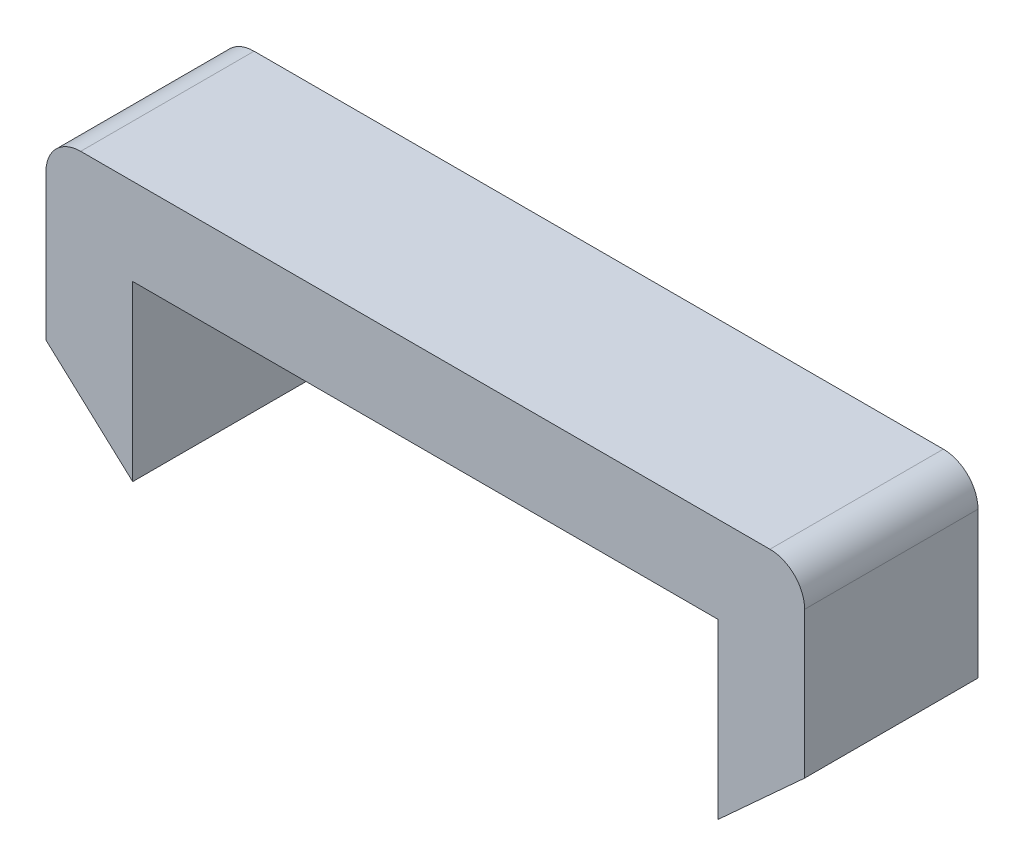
ISO-10303-21;
HEADER;
FILE_DESCRIPTION(('STEP AP214'),'2;1');
FILE_NAME('part.step','',(''),(''),'','','');
FILE_SCHEMA(('AUTOMOTIVE_DESIGN { 1 0 10303 214 1 1 1 1 }'));
ENDSEC;
DATA;
#1=APPLICATION_CONTEXT('core data for automotive mechanical design processes');
#2=APPLICATION_PROTOCOL_DEFINITION('international standard','automotive_design',2000,#1);
#3=PRODUCT_CONTEXT('',#1,'mechanical');
#4=PRODUCT('Part','Part','',(#3));
#5=PRODUCT_RELATED_PRODUCT_CATEGORY('part','',(#4));
#6=PRODUCT_DEFINITION_FORMATION('','',#4);
#7=PRODUCT_DEFINITION_CONTEXT('part definition',#1,'design');
#8=PRODUCT_DEFINITION('design','',#6,#7);
#9=PRODUCT_DEFINITION_SHAPE('','',#8);
#10=(LENGTH_UNIT() NAMED_UNIT(*) SI_UNIT(.MILLI.,.METRE.));
#11=(NAMED_UNIT(*) PLANE_ANGLE_UNIT() SI_UNIT($,.RADIAN.));
#12=(NAMED_UNIT(*) SI_UNIT($,.STERADIAN.) SOLID_ANGLE_UNIT());
#13=UNCERTAINTY_MEASURE_WITH_UNIT(LENGTH_MEASURE(1.E-05),#10,'distance_accuracy_value','');
#14=(GEOMETRIC_REPRESENTATION_CONTEXT(3) GLOBAL_UNCERTAINTY_ASSIGNED_CONTEXT((#13)) GLOBAL_UNIT_ASSIGNED_CONTEXT((#10,
#11,#12)) REPRESENTATION_CONTEXT('',''));
#15=CARTESIAN_POINT('',(0.,0.,0.));
#16=DIRECTION('',(0.,0.,1.));
#17=DIRECTION('',(1.,0.,0.));
#18=AXIS2_PLACEMENT_3D('',#15,#16,#17);
#19=CARTESIAN_POINT('',(-26.9538651840723,16.1515683814145,10.));
#20=DIRECTION('',(1.,0.,0.));
#21=DIRECTION('',(0.,0.,-1.));
#22=AXIS2_PLACEMENT_3D('',#19,#20,#21);
#23=PLANE('',#22);
#24=DIRECTION('',(0.,-1.,0.));
#25=VECTOR('',#24,1.);
#26=CARTESIAN_POINT('',(-26.9538651840723,16.1515683814145,0.));
#27=LINE('',#26,#25);
#28=CARTESIAN_POINT('',(-26.9538651840723,14.1515683814145,0.));
#29=VERTEX_POINT('',#28);
#30=CARTESIAN_POINT('',(-26.9538651840723,5.71818181818184,0.));
#31=VERTEX_POINT('',#30);
#32=EDGE_CURVE('E340',#29,#31,#27,.T.);
#33=ORIENTED_EDGE('',*,*,#32,.T.);
#34=DIRECTION('',(0.,0.,1.));
#35=VECTOR('',#34,1.);
#36=CARTESIAN_POINT('',(-26.9538651840723,5.71818181818182,0.));
#37=LINE('',#36,#35);
#38=CARTESIAN_POINT('',(-26.9538651840723,5.71818181818182,10.));
#39=VERTEX_POINT('',#38);
#40=EDGE_CURVE('E58',#31,#39,#37,.T.);
#41=ORIENTED_EDGE('',*,*,#40,.T.);
#42=DIRECTION('',(0.,-1.,0.));
#43=VECTOR('',#42,1.);
#44=CARTESIAN_POINT('',(-26.9538651840723,16.1515683814145,10.));
#45=LINE('',#44,#43);
#46=CARTESIAN_POINT('',(-26.9538651840723,14.1515683814145,10.));
#47=VERTEX_POINT('',#46);
#48=EDGE_CURVE('E156',#47,#39,#45,.T.);
#49=ORIENTED_EDGE('',*,*,#48,.F.);
#50=DIRECTION('',(0.,0.,-1.));
#51=VECTOR('',#50,1.);
#52=CARTESIAN_POINT('',(-26.9538651840723,14.1515683814145,10.));
#53=LINE('',#52,#51);
#54=EDGE_CURVE('E11',#47,#29,#53,.T.);
#55=ORIENTED_EDGE('',*,*,#54,.T.);
#56=EDGE_LOOP('',(#33,#41,#49,#55));
#57=FACE_BOUND('',#56,.T.);
#58=ADVANCED_FACE('F42',(#57),#23,.F.);
#59=CARTESIAN_POINT('',(-21.9538651840723,1.1515683814145,10.));
#60=DIRECTION('',(-1.,0.,0.));
#61=DIRECTION('',(0.,0.,1.));
#62=AXIS2_PLACEMENT_3D('',#59,#60,#61);
#63=PLANE('',#62);
#64=DIRECTION('',(0.,1.,0.));
#65=VECTOR('',#64,1.);
#66=CARTESIAN_POINT('',(-21.9538651840723,1.1515683814145,0.));
#67=LINE('',#66,#65);
#68=CARTESIAN_POINT('',(-21.9538651840723,1.1515683814145,0.));
#69=VERTEX_POINT('',#68);
#70=CARTESIAN_POINT('',(-21.9538651840723,11.1515683814145,0.));
#71=VERTEX_POINT('',#70);
#72=EDGE_CURVE('E360',#69,#71,#67,.T.);
#73=ORIENTED_EDGE('',*,*,#72,.T.);
#74=DIRECTION('',(0.,0.,-1.));
#75=VECTOR('',#74,1.);
#76=CARTESIAN_POINT('',(-21.9538651840723,11.1515683814145,10.));
#77=LINE('',#76,#75);
#78=CARTESIAN_POINT('',(-21.9538651840723,11.1515683814145,10.));
#79=VERTEX_POINT('',#78);
#80=EDGE_CURVE('E169',#79,#71,#77,.T.);
#81=ORIENTED_EDGE('',*,*,#80,.F.);
#82=DIRECTION('',(0.,1.,0.));
#83=VECTOR('',#82,1.);
#84=CARTESIAN_POINT('',(-21.9538651840723,1.1515683814145,10.));
#85=LINE('',#84,#83);
#86=CARTESIAN_POINT('',(-21.9538651840723,1.1515683814145,10.));
#87=VERTEX_POINT('',#86);
#88=EDGE_CURVE('E344',#87,#79,#85,.T.);
#89=ORIENTED_EDGE('',*,*,#88,.F.);
#90=DIRECTION('',(0.,0.,-1.));
#91=VECTOR('',#90,1.);
#92=CARTESIAN_POINT('',(-21.9538651840723,1.1515683814145,10.));
#93=LINE('',#92,#91);
#94=EDGE_CURVE('E173',#87,#69,#93,.T.);
#95=ORIENTED_EDGE('',*,*,#94,.T.);
#96=EDGE_LOOP('',(#73,#81,#89,#95));
#97=FACE_BOUND('',#96,.T.);
#98=ADVANCED_FACE('F215',(#97),#63,.F.);
#99=CARTESIAN_POINT('',(-21.9538651840723,11.1515683814145,10.));
#100=DIRECTION('',(0.,1.,0.));
#101=DIRECTION('',(0.,0.,1.));
#102=AXIS2_PLACEMENT_3D('',#99,#100,#101);
#103=PLANE('',#102);
#104=DIRECTION('',(1.,0.,0.));
#105=VECTOR('',#104,1.);
#106=CARTESIAN_POINT('',(-21.9538651840723,11.1515683814145,0.));
#107=LINE('',#106,#105);
#108=CARTESIAN_POINT('',(11.7961348159277,11.1515683814145,0.));
#109=VERTEX_POINT('',#108);
#110=EDGE_CURVE('E158',#71,#109,#107,.T.);
#111=ORIENTED_EDGE('',*,*,#110,.T.);
#112=DIRECTION('',(0.,0.,-1.));
#113=VECTOR('',#112,1.);
#114=CARTESIAN_POINT('',(11.7961348159277,11.1515683814145,10.));
#115=LINE('',#114,#113);
#116=CARTESIAN_POINT('',(11.7961348159277,11.1515683814145,10.));
#117=VERTEX_POINT('',#116);
#118=EDGE_CURVE('E164',#117,#109,#115,.T.);
#119=ORIENTED_EDGE('',*,*,#118,.F.);
#120=DIRECTION('',(1.,0.,0.));
#121=VECTOR('',#120,1.);
#122=CARTESIAN_POINT('',(-21.9538651840723,11.1515683814145,10.));
#123=LINE('',#122,#121);
#124=EDGE_CURVE('E347',#79,#117,#123,.T.);
#125=ORIENTED_EDGE('',*,*,#124,.F.);
#126=ORIENTED_EDGE('',*,*,#80,.T.);
#127=EDGE_LOOP('',(#111,#119,#125,#126));
#128=FACE_BOUND('',#127,.T.);
#129=ADVANCED_FACE('F220',(#128),#103,.F.);
#130=CARTESIAN_POINT('',(11.7961348159277,11.1515683814145,10.));
#131=DIRECTION('',(1.,0.,0.));
#132=DIRECTION('',(0.,1.,0.));
#133=AXIS2_PLACEMENT_3D('',#130,#131,#132);
#134=PLANE('',#133);
#135=DIRECTION('',(0.,-1.,0.));
#136=VECTOR('',#135,1.);
#137=CARTESIAN_POINT('',(11.7961348159277,11.1515683814145,0.));
#138=LINE('',#137,#136);
#139=CARTESIAN_POINT('',(11.7961348159277,1.1515683814145,0.));
#140=VERTEX_POINT('',#139);
#141=EDGE_CURVE('E151',#109,#140,#138,.T.);
#142=ORIENTED_EDGE('',*,*,#141,.T.);
#143=DIRECTION('',(0.,0.,-1.));
#144=VECTOR('',#143,1.);
#145=CARTESIAN_POINT('',(11.7961348159277,1.1515683814145,10.));
#146=LINE('',#145,#144);
#147=CARTESIAN_POINT('',(11.7961348159277,1.1515683814145,10.));
#148=VERTEX_POINT('',#147);
#149=EDGE_CURVE('E127',#148,#140,#146,.T.);
#150=ORIENTED_EDGE('',*,*,#149,.F.);
#151=DIRECTION('',(0.,-1.,0.));
#152=VECTOR('',#151,1.);
#153=CARTESIAN_POINT('',(11.7961348159277,11.1515683814145,10.));
#154=LINE('',#153,#152);
#155=EDGE_CURVE('E352',#117,#148,#154,.T.);
#156=ORIENTED_EDGE('',*,*,#155,.F.);
#157=ORIENTED_EDGE('',*,*,#118,.T.);
#158=EDGE_LOOP('',(#142,#150,#156,#157));
#159=FACE_BOUND('',#158,.T.);
#160=ADVANCED_FACE('F227',(#159),#134,.F.);
#161=CARTESIAN_POINT('',(16.7961348159277,1.1515683814145,10.));
#162=DIRECTION('',(-1.,0.,0.));
#163=DIRECTION('',(0.,0.,1.));
#164=AXIS2_PLACEMENT_3D('',#161,#162,#163);
#165=PLANE('',#164);
#166=DIRECTION('',(0.,1.,0.));
#167=VECTOR('',#166,1.);
#168=CARTESIAN_POINT('',(16.7961348159277,1.1515683814145,10.));
#169=LINE('',#168,#167);
#170=CARTESIAN_POINT('',(16.7961348159277,5.71818181818182,10.));
#171=VERTEX_POINT('',#170);
#172=CARTESIAN_POINT('',(16.7961348159277,14.1515683814145,10.));
#173=VERTEX_POINT('',#172);
#174=EDGE_CURVE('E141',#171,#173,#169,.T.);
#175=ORIENTED_EDGE('',*,*,#174,.F.);
#176=DIRECTION('',(0.,0.,1.));
#177=VECTOR('',#176,1.);
#178=CARTESIAN_POINT('',(16.7961348159277,5.71818181818182,0.));
#179=LINE('',#178,#177);
#180=CARTESIAN_POINT('',(16.7961348159277,5.71818181818182,0.));
#181=VERTEX_POINT('',#180);
#182=EDGE_CURVE('E124',#181,#171,#179,.T.);
#183=ORIENTED_EDGE('',*,*,#182,.F.);
#184=DIRECTION('',(0.,1.,0.));
#185=VECTOR('',#184,1.);
#186=CARTESIAN_POINT('',(16.7961348159277,1.1515683814145,0.));
#187=LINE('',#186,#185);
#188=CARTESIAN_POINT('',(16.7961348159277,14.1515683814145,0.));
#189=VERTEX_POINT('',#188);
#190=EDGE_CURVE('E139',#181,#189,#187,.T.);
#191=ORIENTED_EDGE('',*,*,#190,.T.);
#192=DIRECTION('',(0.,0.,-1.));
#193=VECTOR('',#192,1.);
#194=CARTESIAN_POINT('',(16.7961348159277,14.1515683814145,10.));
#195=LINE('',#194,#193);
#196=EDGE_CURVE('E189',#189,#173,#195,.F.);
#197=ORIENTED_EDGE('',*,*,#196,.T.);
#198=EDGE_LOOP('',(#175,#183,#191,#197));
#199=FACE_BOUND('',#198,.T.);
#200=ADVANCED_FACE('F137',(#199),#165,.F.);
#201=CARTESIAN_POINT('',(16.7961348159277,16.1515683814145,10.));
#202=DIRECTION('',(0.,-1.,0.));
#203=DIRECTION('',(1.,0.,0.));
#204=AXIS2_PLACEMENT_3D('',#201,#202,#203);
#205=PLANE('',#204);
#206=DIRECTION('',(-1.,0.,0.));
#207=VECTOR('',#206,1.);
#208=CARTESIAN_POINT('',(16.7961348159277,16.1515683814145,10.));
#209=LINE('',#208,#207);
#210=CARTESIAN_POINT('',(14.7961348159277,16.1515683814145,10.));
#211=VERTEX_POINT('',#210);
#212=CARTESIAN_POINT('',(-24.9538651840723,16.1515683814145,10.));
#213=VERTEX_POINT('',#212);
#214=EDGE_CURVE('E165',#211,#213,#209,.T.);
#215=ORIENTED_EDGE('',*,*,#214,.F.);
#216=DIRECTION('',(0.,0.,-1.));
#217=VECTOR('',#216,1.);
#218=CARTESIAN_POINT('',(14.7961348159277,16.1515683814145,10.));
#219=LINE('',#218,#217);
#220=CARTESIAN_POINT('',(14.7961348159277,16.1515683814145,0.));
#221=VERTEX_POINT('',#220);
#222=EDGE_CURVE('E180',#211,#221,#219,.T.);
#223=ORIENTED_EDGE('',*,*,#222,.T.);
#224=DIRECTION('',(-1.,0.,0.));
#225=VECTOR('',#224,1.);
#226=CARTESIAN_POINT('',(16.7961348159277,16.1515683814145,0.));
#227=LINE('',#226,#225);
#228=CARTESIAN_POINT('',(-24.9538651840723,16.1515683814145,0.));
#229=VERTEX_POINT('',#228);
#230=EDGE_CURVE('E150',#221,#229,#227,.T.);
#231=ORIENTED_EDGE('',*,*,#230,.T.);
#232=DIRECTION('',(0.,0.,-1.));
#233=VECTOR('',#232,1.);
#234=CARTESIAN_POINT('',(-24.9538651840723,16.1515683814145,10.));
#235=LINE('',#234,#233);
#236=EDGE_CURVE('E177',#229,#213,#235,.F.);
#237=ORIENTED_EDGE('',*,*,#236,.T.);
#238=EDGE_LOOP('',(#215,#223,#231,#237));
#239=FACE_BOUND('',#238,.T.);
#240=ADVANCED_FACE('F200',(#239),#205,.F.);
#241=CARTESIAN_POINT('',(0.,0.,10.));
#242=DIRECTION('',(0.,0.,1.));
#243=DIRECTION('',(1.,0.,0.));
#244=AXIS2_PLACEMENT_3D('',#241,#242,#243);
#245=PLANE('',#244);
#246=DIRECTION('',(-0.738382828848168,-0.674381789539262,0.));
#247=VECTOR('',#246,1.);
#248=CARTESIAN_POINT('',(16.7961348159277,5.71818181818182,10.));
#249=LINE('',#248,#247);
#250=EDGE_CURVE('E133',#171,#148,#249,.T.);
#251=ORIENTED_EDGE('',*,*,#250,.F.);
#252=ORIENTED_EDGE('',*,*,#174,.T.);
#253=CARTESIAN_POINT('',(14.7961348159277,14.1515683814145,10.));
#254=DIRECTION('',(0.,0.,1.));
#255=DIRECTION('',(1.,0.,0.));
#256=AXIS2_PLACEMENT_3D('',#253,#254,#255);
#257=CIRCLE('',#256,2.);
#258=EDGE_CURVE('E51',#173,#211,#257,.T.);
#259=ORIENTED_EDGE('',*,*,#258,.T.);
#260=ORIENTED_EDGE('',*,*,#214,.T.);
#261=CARTESIAN_POINT('',(-24.9538651840723,14.1515683814145,10.));
#262=DIRECTION('',(0.,0.,1.));
#263=DIRECTION('',(1.,0.,0.));
#264=AXIS2_PLACEMENT_3D('',#261,#262,#263);
#265=CIRCLE('',#264,2.);
#266=EDGE_CURVE('E66',#213,#47,#265,.T.);
#267=ORIENTED_EDGE('',*,*,#266,.T.);
#268=ORIENTED_EDGE('',*,*,#48,.T.);
#269=DIRECTION('',(-0.738382828848168,0.674381789539262,0.));
#270=VECTOR('',#269,1.);
#271=CARTESIAN_POINT('',(-26.9538651840723,5.71818181818182,10.));
#272=LINE('',#271,#270);
#273=EDGE_CURVE('E143',#87,#39,#272,.T.);
#274=ORIENTED_EDGE('',*,*,#273,.F.);
#275=ORIENTED_EDGE('',*,*,#88,.T.);
#276=ORIENTED_EDGE('',*,*,#124,.T.);
#277=ORIENTED_EDGE('',*,*,#155,.T.);
#278=EDGE_LOOP('',(#251,#252,#259,#260,#267,#268,#274,#275,#276,#277));
#279=FACE_BOUND('',#278,.T.);
#280=ADVANCED_FACE('F196',(#279),#245,.T.);
#281=CARTESIAN_POINT('',(0.,0.,0.));
#282=DIRECTION('',(0.,0.,1.));
#283=DIRECTION('',(1.,0.,0.));
#284=AXIS2_PLACEMENT_3D('',#281,#282,#283);
#285=PLANE('',#284);
#286=ORIENTED_EDGE('',*,*,#190,.F.);
#287=DIRECTION('',(-0.738382828848168,-0.674381789539262,0.));
#288=VECTOR('',#287,1.);
#289=CARTESIAN_POINT('',(16.7961348159277,5.71818181818182,0.));
#290=LINE('',#289,#288);
#291=EDGE_CURVE('E121',#181,#140,#290,.T.);
#292=ORIENTED_EDGE('',*,*,#291,.T.);
#293=ORIENTED_EDGE('',*,*,#141,.F.);
#294=ORIENTED_EDGE('',*,*,#110,.F.);
#295=ORIENTED_EDGE('',*,*,#72,.F.);
#296=DIRECTION('',(-0.738382828848168,0.674381789539262,0.));
#297=VECTOR('',#296,1.);
#298=CARTESIAN_POINT('',(-26.9538651840723,5.71818181818182,0.));
#299=LINE('',#298,#297);
#300=EDGE_CURVE('E336',#69,#31,#299,.T.);
#301=ORIENTED_EDGE('',*,*,#300,.T.);
#302=ORIENTED_EDGE('',*,*,#32,.F.);
#303=CARTESIAN_POINT('',(-24.9538651840723,14.1515683814145,0.));
#304=DIRECTION('',(0.,0.,1.));
#305=DIRECTION('',(1.,0.,0.));
#306=AXIS2_PLACEMENT_3D('',#303,#304,#305);
#307=CIRCLE('',#306,2.);
#308=EDGE_CURVE('E184',#29,#229,#307,.F.);
#309=ORIENTED_EDGE('',*,*,#308,.T.);
#310=ORIENTED_EDGE('',*,*,#230,.F.);
#311=CARTESIAN_POINT('',(14.7961348159277,14.1515683814145,0.));
#312=DIRECTION('',(0.,0.,1.));
#313=DIRECTION('',(1.,0.,0.));
#314=AXIS2_PLACEMENT_3D('',#311,#312,#313);
#315=CIRCLE('',#314,2.);
#316=EDGE_CURVE('E147',#221,#189,#315,.F.);
#317=ORIENTED_EDGE('',*,*,#316,.T.);
#318=EDGE_LOOP('',(#286,#292,#293,#294,#295,#301,#302,#309,#310,#317));
#319=FACE_BOUND('',#318,.T.);
#320=ADVANCED_FACE('F145',(#319),#285,.F.);
#321=CARTESIAN_POINT('',(14.7961348159277,14.1515683814145,10.));
#322=DIRECTION('',(0.,0.,-1.));
#323=DIRECTION('',(-1.,0.,0.));
#324=AXIS2_PLACEMENT_3D('',#321,#322,#323);
#325=CYLINDRICAL_SURFACE('',#324,2.);
#326=ORIENTED_EDGE('',*,*,#258,.F.);
#327=ORIENTED_EDGE('',*,*,#196,.F.);
#328=ORIENTED_EDGE('',*,*,#316,.F.);
#329=ORIENTED_EDGE('',*,*,#222,.F.);
#330=EDGE_LOOP('',(#326,#327,#328,#329));
#331=FACE_BOUND('',#330,.T.);
#332=ADVANCED_FACE('F204',(#331),#325,.T.);
#333=CARTESIAN_POINT('',(-24.9538651840723,14.1515683814145,10.));
#334=DIRECTION('',(0.,0.,-1.));
#335=DIRECTION('',(-1.,0.,0.));
#336=AXIS2_PLACEMENT_3D('',#333,#334,#335);
#337=CYLINDRICAL_SURFACE('',#336,2.);
#338=ORIENTED_EDGE('',*,*,#266,.F.);
#339=ORIENTED_EDGE('',*,*,#236,.F.);
#340=ORIENTED_EDGE('',*,*,#308,.F.);
#341=ORIENTED_EDGE('',*,*,#54,.F.);
#342=EDGE_LOOP('',(#338,#339,#340,#341));
#343=FACE_BOUND('',#342,.T.);
#344=ADVANCED_FACE('F44',(#343),#337,.T.);
#345=CARTESIAN_POINT('',(-26.9538651840723,5.71818181818182,0.));
#346=DIRECTION('',(0.674381789539262,0.738382828848168,0.));
#347=DIRECTION('',(-0.738382828848168,0.674381789539262,0.));
#348=AXIS2_PLACEMENT_3D('',#345,#346,#347);
#349=PLANE('',#348);
#350=ORIENTED_EDGE('',*,*,#273,.T.);
#351=ORIENTED_EDGE('',*,*,#40,.F.);
#352=ORIENTED_EDGE('',*,*,#300,.F.);
#353=ORIENTED_EDGE('',*,*,#94,.F.);
#354=EDGE_LOOP('',(#350,#351,#352,#353));
#355=FACE_BOUND('',#354,.T.);
#356=ADVANCED_FACE('F210',(#355),#349,.F.);
#357=CARTESIAN_POINT('',(16.7961348159277,5.71818181818182,0.));
#358=DIRECTION('',(-0.674381789539262,0.738382828848168,0.));
#359=DIRECTION('',(-0.738382828848168,-0.674381789539262,0.));
#360=AXIS2_PLACEMENT_3D('',#357,#358,#359);
#361=PLANE('',#360);
#362=ORIENTED_EDGE('',*,*,#250,.T.);
#363=ORIENTED_EDGE('',*,*,#149,.T.);
#364=ORIENTED_EDGE('',*,*,#291,.F.);
#365=ORIENTED_EDGE('',*,*,#182,.T.);
#366=EDGE_LOOP('',(#362,#363,#364,#365));
#367=FACE_BOUND('',#366,.T.);
#368=ADVANCED_FACE('F123',(#367),#361,.F.);
#369=CLOSED_SHELL('',(#58,#98,#129,#160,#200,#240,#280,#320,#332,#344,#356,#368));
#370=MANIFOLD_SOLID_BREP('B2',#369);
#371=ADVANCED_BREP_SHAPE_REPRESENTATION('',(#18,#370),#14);
#372=SHAPE_DEFINITION_REPRESENTATION(#9,#371);
ENDSEC;
END-ISO-10303-21;
